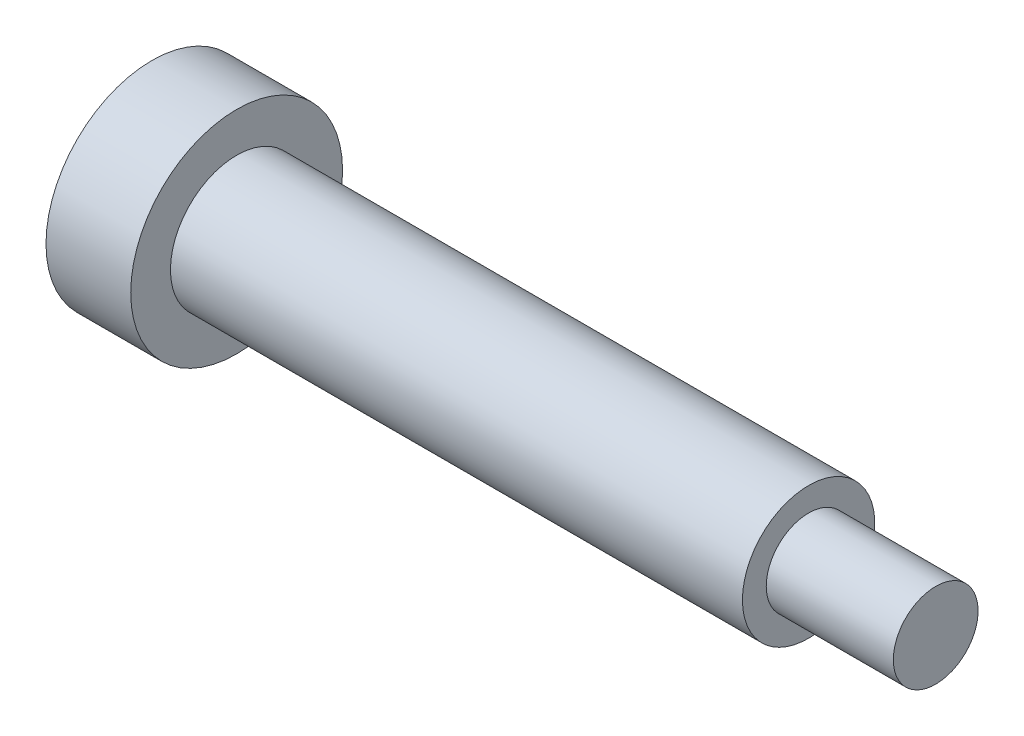
ISO-10303-21;
HEADER;
FILE_DESCRIPTION(('STEP AP214'),'2;1');
FILE_NAME('part.step','',(''),(''),'','','');
FILE_SCHEMA(('AUTOMOTIVE_DESIGN { 1 0 10303 214 1 1 1 1 }'));
ENDSEC;
DATA;
#1=APPLICATION_CONTEXT('core data for automotive mechanical design processes');
#2=APPLICATION_PROTOCOL_DEFINITION('international standard','automotive_design',2000,#1);
#3=PRODUCT_CONTEXT('',#1,'mechanical');
#4=PRODUCT('Part','Part','',(#3));
#5=PRODUCT_RELATED_PRODUCT_CATEGORY('part','',(#4));
#6=PRODUCT_DEFINITION_FORMATION('','',#4);
#7=PRODUCT_DEFINITION_CONTEXT('part definition',#1,'design');
#8=PRODUCT_DEFINITION('design','',#6,#7);
#9=PRODUCT_DEFINITION_SHAPE('','',#8);
#10=(LENGTH_UNIT() NAMED_UNIT(*) SI_UNIT(.MILLI.,.METRE.));
#11=(NAMED_UNIT(*) PLANE_ANGLE_UNIT() SI_UNIT($,.RADIAN.));
#12=(NAMED_UNIT(*) SI_UNIT($,.STERADIAN.) SOLID_ANGLE_UNIT());
#13=UNCERTAINTY_MEASURE_WITH_UNIT(LENGTH_MEASURE(1.E-05),#10,'distance_accuracy_value','');
#14=(GEOMETRIC_REPRESENTATION_CONTEXT(3) GLOBAL_UNCERTAINTY_ASSIGNED_CONTEXT((#13)) GLOBAL_UNIT_ASSIGNED_CONTEXT((#10,
#11,#12)) REPRESENTATION_CONTEXT('',''));
#15=CARTESIAN_POINT('',(0.,0.,0.));
#16=DIRECTION('',(0.,0.,1.));
#17=DIRECTION('',(1.,0.,0.));
#18=AXIS2_PLACEMENT_3D('',#15,#16,#17);
#19=CARTESIAN_POINT('',(0.,0.,0.));
#20=DIRECTION('',(1.,0.,0.));
#21=DIRECTION('',(0.,0.,-1.));
#22=AXIS2_PLACEMENT_3D('',#19,#20,#21);
#23=PLANE('',#22);
#24=CARTESIAN_POINT('',(0.,0.,0.));
#25=DIRECTION('',(-1.,0.,0.));
#26=DIRECTION('',(0.,0.,1.));
#27=AXIS2_PLACEMENT_3D('',#24,#25,#26);
#28=CIRCLE('',#27,5.);
#29=CARTESIAN_POINT('',(0.,0.,5.));
#30=VERTEX_POINT('',#29);
#31=EDGE_CURVE('E10',#30,#30,#28,.T.);
#32=ORIENTED_EDGE('',*,*,#31,.T.);
#33=EDGE_LOOP('',(#32));
#34=FACE_BOUND('',#33,.T.);
#35=ADVANCED_FACE('F35',(#34),#23,.F.);
#36=CARTESIAN_POINT('',(0.,0.,0.));
#37=DIRECTION('',(-1.,0.,0.));
#38=DIRECTION('',(0.,0.,1.));
#39=AXIS2_PLACEMENT_3D('',#36,#37,#38);
#40=CYLINDRICAL_SURFACE('',#39,5.);
#41=ORIENTED_EDGE('',*,*,#31,.F.);
#42=EDGE_LOOP('',(#41));
#43=FACE_BOUND('',#42,.T.);
#44=CARTESIAN_POINT('',(4.,0.,0.));
#45=DIRECTION('',(-1.,0.,0.));
#46=DIRECTION('',(0.,0.,1.));
#47=AXIS2_PLACEMENT_3D('',#44,#45,#46);
#48=CIRCLE('',#47,5.);
#49=CARTESIAN_POINT('',(4.,0.,5.));
#50=VERTEX_POINT('',#49);
#51=EDGE_CURVE('E41',#50,#50,#48,.T.);
#52=ORIENTED_EDGE('',*,*,#51,.T.);
#53=EDGE_LOOP('',(#52));
#54=FACE_BOUND('',#53,.T.);
#55=ADVANCED_FACE('F73',(#43,#54),#40,.T.);
#56=CARTESIAN_POINT('',(4.,5.,0.));
#57=DIRECTION('',(-1.,0.,0.));
#58=DIRECTION('',(0.,0.,1.));
#59=AXIS2_PLACEMENT_3D('',#56,#57,#58);
#60=PLANE('',#59);
#61=ORIENTED_EDGE('',*,*,#51,.F.);
#62=EDGE_LOOP('',(#61));
#63=FACE_BOUND('',#62,.T.);
#64=CARTESIAN_POINT('',(4.,0.,0.));
#65=DIRECTION('',(-1.,0.,0.));
#66=DIRECTION('',(0.,0.,1.));
#67=AXIS2_PLACEMENT_3D('',#64,#65,#66);
#68=CIRCLE('',#67,3.125);
#69=CARTESIAN_POINT('',(4.,0.,3.125));
#70=VERTEX_POINT('',#69);
#71=EDGE_CURVE('E45',#70,#70,#68,.T.);
#72=ORIENTED_EDGE('',*,*,#71,.T.);
#73=EDGE_LOOP('',(#72));
#74=FACE_BOUND('',#73,.T.);
#75=ADVANCED_FACE('F77',(#63,#74),#60,.F.);
#76=CARTESIAN_POINT('',(0.,0.,0.));
#77=DIRECTION('',(-1.,0.,0.));
#78=DIRECTION('',(0.,0.,1.));
#79=AXIS2_PLACEMENT_3D('',#76,#77,#78);
#80=CYLINDRICAL_SURFACE('',#79,3.125);
#81=ORIENTED_EDGE('',*,*,#71,.F.);
#82=EDGE_LOOP('',(#81));
#83=FACE_BOUND('',#82,.T.);
#84=CARTESIAN_POINT('',(31.,0.,0.));
#85=DIRECTION('',(-1.,0.,0.));
#86=DIRECTION('',(0.,0.,1.));
#87=AXIS2_PLACEMENT_3D('',#84,#85,#86);
#88=CIRCLE('',#87,3.125);
#89=CARTESIAN_POINT('',(31.,0.,3.125));
#90=VERTEX_POINT('',#89);
#91=EDGE_CURVE('E49',#90,#90,#88,.T.);
#92=ORIENTED_EDGE('',*,*,#91,.T.);
#93=EDGE_LOOP('',(#92));
#94=FACE_BOUND('',#93,.T.);
#95=ADVANCED_FACE('F82',(#83,#94),#80,.T.);
#96=CARTESIAN_POINT('',(31.,3.125,0.));
#97=DIRECTION('',(-1.,0.,0.));
#98=DIRECTION('',(0.,0.,1.));
#99=AXIS2_PLACEMENT_3D('',#96,#97,#98);
#100=PLANE('',#99);
#101=ORIENTED_EDGE('',*,*,#91,.F.);
#102=EDGE_LOOP('',(#101));
#103=FACE_BOUND('',#102,.T.);
#104=CARTESIAN_POINT('',(31.,0.,0.));
#105=DIRECTION('',(-1.,0.,0.));
#106=DIRECTION('',(0.,0.,1.));
#107=AXIS2_PLACEMENT_3D('',#104,#105,#106);
#108=CIRCLE('',#107,2.);
#109=CARTESIAN_POINT('',(31.,0.,2.));
#110=VERTEX_POINT('',#109);
#111=EDGE_CURVE('E54',#110,#110,#108,.T.);
#112=ORIENTED_EDGE('',*,*,#111,.T.);
#113=EDGE_LOOP('',(#112));
#114=FACE_BOUND('',#113,.T.);
#115=ADVANCED_FACE('F69',(#103,#114),#100,.F.);
#116=CARTESIAN_POINT('',(0.,0.,0.));
#117=DIRECTION('',(-1.,0.,0.));
#118=DIRECTION('',(0.,0.,1.));
#119=AXIS2_PLACEMENT_3D('',#116,#117,#118);
#120=CYLINDRICAL_SURFACE('',#119,2.);
#121=ORIENTED_EDGE('',*,*,#111,.F.);
#122=EDGE_LOOP('',(#121));
#123=FACE_BOUND('',#122,.T.);
#124=CARTESIAN_POINT('',(37.,0.,0.));
#125=DIRECTION('',(-1.,0.,0.));
#126=DIRECTION('',(0.,0.,1.));
#127=AXIS2_PLACEMENT_3D('',#124,#125,#126);
#128=CIRCLE('',#127,2.);
#129=CARTESIAN_POINT('',(37.,0.,2.));
#130=VERTEX_POINT('',#129);
#131=EDGE_CURVE('E57',#130,#130,#128,.T.);
#132=ORIENTED_EDGE('',*,*,#131,.T.);
#133=EDGE_LOOP('',(#132));
#134=FACE_BOUND('',#133,.T.);
#135=ADVANCED_FACE('F61',(#123,#134),#120,.T.);
#136=CARTESIAN_POINT('',(37.,2.,0.));
#137=DIRECTION('',(-1.,0.,0.));
#138=DIRECTION('',(0.,0.,1.));
#139=AXIS2_PLACEMENT_3D('',#136,#137,#138);
#140=PLANE('',#139);
#141=ORIENTED_EDGE('',*,*,#131,.F.);
#142=EDGE_LOOP('',(#141));
#143=FACE_BOUND('',#142,.T.);
#144=ADVANCED_FACE('F63',(#143),#140,.F.);
#145=CLOSED_SHELL('',(#35,#55,#75,#95,#115,#135,#144));
#146=MANIFOLD_SOLID_BREP('B2',#145);
#147=ADVANCED_BREP_SHAPE_REPRESENTATION('',(#18,#146),#14);
#148=SHAPE_DEFINITION_REPRESENTATION(#9,#147);
ENDSEC;
END-ISO-10303-21;
